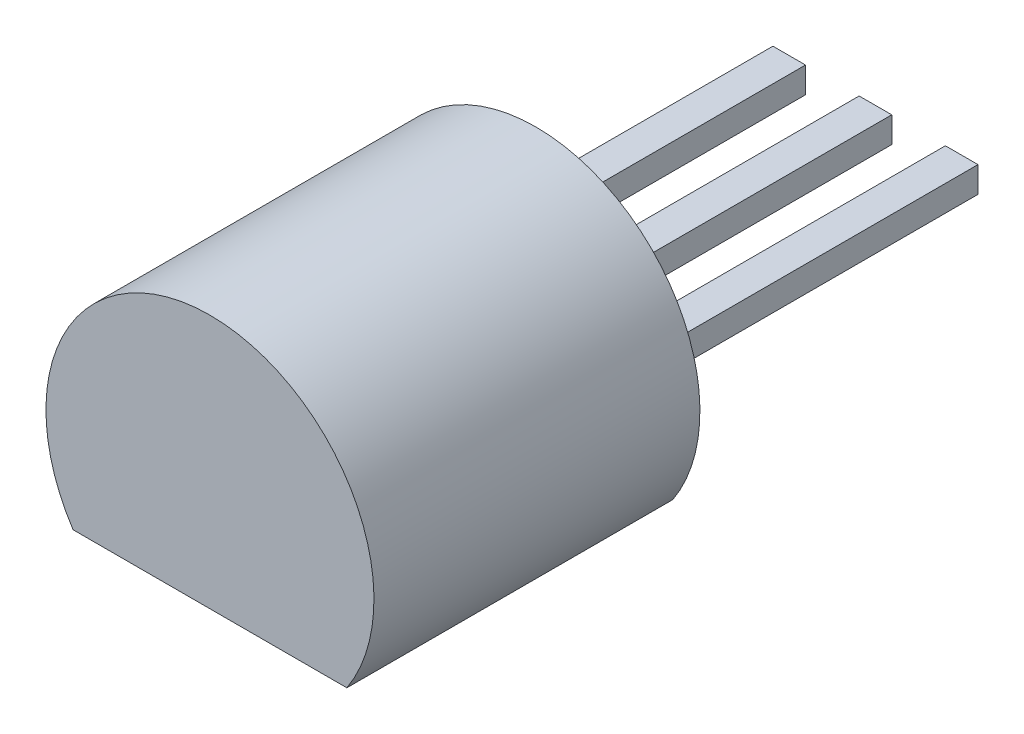
ISO-10303-21;
HEADER;
FILE_DESCRIPTION(('STEP AP214'),'2;1');
FILE_NAME('part.step','',(''),(''),'','','');
FILE_SCHEMA(('AUTOMOTIVE_DESIGN { 1 0 10303 214 1 1 1 1 }'));
ENDSEC;
DATA;
#1=APPLICATION_CONTEXT('core data for automotive mechanical design processes');
#2=APPLICATION_PROTOCOL_DEFINITION('international standard','automotive_design',2000,#1);
#3=PRODUCT_CONTEXT('',#1,'mechanical');
#4=PRODUCT('Part','Part','',(#3));
#5=PRODUCT_RELATED_PRODUCT_CATEGORY('part','',(#4));
#6=PRODUCT_DEFINITION_FORMATION('','',#4);
#7=PRODUCT_DEFINITION_CONTEXT('part definition',#1,'design');
#8=PRODUCT_DEFINITION('design','',#6,#7);
#9=PRODUCT_DEFINITION_SHAPE('','',#8);
#10=(LENGTH_UNIT() NAMED_UNIT(*) SI_UNIT(.MILLI.,.METRE.));
#11=(NAMED_UNIT(*) PLANE_ANGLE_UNIT() SI_UNIT($,.RADIAN.));
#12=(NAMED_UNIT(*) SI_UNIT($,.STERADIAN.) SOLID_ANGLE_UNIT());
#13=UNCERTAINTY_MEASURE_WITH_UNIT(LENGTH_MEASURE(1.E-05),#10,'distance_accuracy_value','');
#14=(GEOMETRIC_REPRESENTATION_CONTEXT(3) GLOBAL_UNCERTAINTY_ASSIGNED_CONTEXT((#13)) GLOBAL_UNIT_ASSIGNED_CONTEXT((#10,
#11,#12)) REPRESENTATION_CONTEXT('',''));
#15=CARTESIAN_POINT('',(0.,0.,0.));
#16=DIRECTION('',(0.,0.,1.));
#17=DIRECTION('',(1.,0.,0.));
#18=AXIS2_PLACEMENT_3D('',#15,#16,#17);
#19=CARTESIAN_POINT('',(2.3,0.19,-2.5));
#20=DIRECTION('',(0.,0.,1.));
#21=DIRECTION('',(1.,0.,0.));
#22=AXIS2_PLACEMENT_3D('',#19,#20,#21);
#23=PLANE('',#22);
#24=DIRECTION('',(1.,0.,0.));
#25=VECTOR('',#24,1.);
#26=CARTESIAN_POINT('',(2.3,0.19,-2.5));
#27=LINE('',#26,#25);
#28=CARTESIAN_POINT('',(2.3,0.19,-2.5));
#29=VERTEX_POINT('',#28);
#30=CARTESIAN_POINT('',(2.78,0.19,-2.5));
#31=VERTEX_POINT('',#30);
#32=EDGE_CURVE('E11',#29,#31,#27,.T.);
#33=ORIENTED_EDGE('',*,*,#32,.T.);
#34=DIRECTION('',(0.,-1.,0.));
#35=VECTOR('',#34,1.);
#36=CARTESIAN_POINT('',(2.78,0.19,-2.5));
#37=LINE('',#36,#35);
#38=CARTESIAN_POINT('',(2.78,-0.19,-2.5));
#39=VERTEX_POINT('',#38);
#40=EDGE_CURVE('E131',#31,#39,#37,.T.);
#41=ORIENTED_EDGE('',*,*,#40,.T.);
#42=DIRECTION('',(-1.,0.,0.));
#43=VECTOR('',#42,1.);
#44=CARTESIAN_POINT('',(2.78,-0.19,-2.5));
#45=LINE('',#44,#43);
#46=CARTESIAN_POINT('',(2.3,-0.19,-2.5));
#47=VERTEX_POINT('',#46);
#48=EDGE_CURVE('E239',#39,#47,#45,.T.);
#49=ORIENTED_EDGE('',*,*,#48,.T.);
#50=DIRECTION('',(0.,1.,0.));
#51=VECTOR('',#50,1.);
#52=CARTESIAN_POINT('',(2.3,-0.19,-2.5));
#53=LINE('',#52,#51);
#54=EDGE_CURVE('E28',#47,#29,#53,.T.);
#55=ORIENTED_EDGE('',*,*,#54,.T.);
#56=EDGE_LOOP('',(#33,#41,#49,#55));
#57=FACE_BOUND('',#56,.T.);
#58=ADVANCED_FACE('F17',(#57),#23,.F.);
#59=CARTESIAN_POINT('',(-0.24,0.19,-2.5));
#60=DIRECTION('',(0.,0.,1.));
#61=DIRECTION('',(1.,0.,0.));
#62=AXIS2_PLACEMENT_3D('',#59,#60,#61);
#63=PLANE('',#62);
#64=DIRECTION('',(1.,0.,0.));
#65=VECTOR('',#64,1.);
#66=CARTESIAN_POINT('',(-0.24,0.19,-2.5));
#67=LINE('',#66,#65);
#68=CARTESIAN_POINT('',(-0.24,0.19,-2.5));
#69=VERTEX_POINT('',#68);
#70=CARTESIAN_POINT('',(0.24,0.19,-2.5));
#71=VERTEX_POINT('',#70);
#72=EDGE_CURVE('E242',#69,#71,#67,.T.);
#73=ORIENTED_EDGE('',*,*,#72,.T.);
#74=DIRECTION('',(0.,-1.,0.));
#75=VECTOR('',#74,1.);
#76=CARTESIAN_POINT('',(0.24,0.19,-2.5));
#77=LINE('',#76,#75);
#78=CARTESIAN_POINT('',(0.24,-0.19,-2.5));
#79=VERTEX_POINT('',#78);
#80=EDGE_CURVE('E152',#71,#79,#77,.T.);
#81=ORIENTED_EDGE('',*,*,#80,.T.);
#82=DIRECTION('',(-1.,0.,0.));
#83=VECTOR('',#82,1.);
#84=CARTESIAN_POINT('',(0.24,-0.19,-2.5));
#85=LINE('',#84,#83);
#86=CARTESIAN_POINT('',(-0.24,-0.19,-2.5));
#87=VERTEX_POINT('',#86);
#88=EDGE_CURVE('E175',#79,#87,#85,.T.);
#89=ORIENTED_EDGE('',*,*,#88,.T.);
#90=DIRECTION('',(0.,1.,0.));
#91=VECTOR('',#90,1.);
#92=CARTESIAN_POINT('',(-0.24,-0.19,-2.5));
#93=LINE('',#92,#91);
#94=EDGE_CURVE('E247',#87,#69,#93,.T.);
#95=ORIENTED_EDGE('',*,*,#94,.T.);
#96=EDGE_LOOP('',(#73,#81,#89,#95));
#97=FACE_BOUND('',#96,.T.);
#98=ADVANCED_FACE('F390',(#97),#63,.F.);
#99=CARTESIAN_POINT('',(1.03,0.19,-2.5));
#100=DIRECTION('',(0.,0.,1.));
#101=DIRECTION('',(1.,0.,0.));
#102=AXIS2_PLACEMENT_3D('',#99,#100,#101);
#103=PLANE('',#102);
#104=DIRECTION('',(1.,0.,0.));
#105=VECTOR('',#104,1.);
#106=CARTESIAN_POINT('',(1.03,0.19,-2.5));
#107=LINE('',#106,#105);
#108=CARTESIAN_POINT('',(1.03,0.19,-2.5));
#109=VERTEX_POINT('',#108);
#110=CARTESIAN_POINT('',(1.51,0.19,-2.5));
#111=VERTEX_POINT('',#110);
#112=EDGE_CURVE('E205',#109,#111,#107,.T.);
#113=ORIENTED_EDGE('',*,*,#112,.T.);
#114=DIRECTION('',(0.,-1.,0.));
#115=VECTOR('',#114,1.);
#116=CARTESIAN_POINT('',(1.51,0.19,-2.5));
#117=LINE('',#116,#115);
#118=CARTESIAN_POINT('',(1.51,-0.19,-2.5));
#119=VERTEX_POINT('',#118);
#120=EDGE_CURVE('E209',#111,#119,#117,.T.);
#121=ORIENTED_EDGE('',*,*,#120,.T.);
#122=DIRECTION('',(-1.,0.,0.));
#123=VECTOR('',#122,1.);
#124=CARTESIAN_POINT('',(1.51,-0.19,-2.5));
#125=LINE('',#124,#123);
#126=CARTESIAN_POINT('',(1.03,-0.19,-2.5));
#127=VERTEX_POINT('',#126);
#128=EDGE_CURVE('E167',#119,#127,#125,.T.);
#129=ORIENTED_EDGE('',*,*,#128,.T.);
#130=DIRECTION('',(0.,1.,0.));
#131=VECTOR('',#130,1.);
#132=CARTESIAN_POINT('',(1.03,-0.19,-2.5));
#133=LINE('',#132,#131);
#134=EDGE_CURVE('E219',#127,#109,#133,.T.);
#135=ORIENTED_EDGE('',*,*,#134,.T.);
#136=EDGE_LOOP('',(#113,#121,#129,#135));
#137=FACE_BOUND('',#136,.T.);
#138=ADVANCED_FACE('F294',(#137),#103,.F.);
#139=CARTESIAN_POINT('',(2.3,0.19,2.5));
#140=DIRECTION('',(0.,-1.,0.));
#141=DIRECTION('',(0.,0.,-1.));
#142=AXIS2_PLACEMENT_3D('',#139,#140,#141);
#143=PLANE('',#142);
#144=DIRECTION('',(1.,0.,0.));
#145=VECTOR('',#144,1.);
#146=CARTESIAN_POINT('',(2.3,0.19,2.5));
#147=LINE('',#146,#145);
#148=CARTESIAN_POINT('',(2.3,0.19,2.5));
#149=VERTEX_POINT('',#148);
#150=CARTESIAN_POINT('',(2.78,0.19,2.5));
#151=VERTEX_POINT('',#150);
#152=EDGE_CURVE('E138',#149,#151,#147,.T.);
#153=ORIENTED_EDGE('',*,*,#152,.T.);
#154=DIRECTION('',(0.,0.,-1.));
#155=VECTOR('',#154,1.);
#156=CARTESIAN_POINT('',(2.78,0.19,2.5));
#157=LINE('',#156,#155);
#158=EDGE_CURVE('E135',#151,#31,#157,.T.);
#159=ORIENTED_EDGE('',*,*,#158,.T.);
#160=ORIENTED_EDGE('',*,*,#32,.F.);
#161=DIRECTION('',(0.,0.,-1.));
#162=VECTOR('',#161,1.);
#163=CARTESIAN_POINT('',(2.3,0.19,2.5));
#164=LINE('',#163,#162);
#165=EDGE_CURVE('E189',#149,#29,#164,.T.);
#166=ORIENTED_EDGE('',*,*,#165,.F.);
#167=EDGE_LOOP('',(#153,#159,#160,#166));
#168=FACE_BOUND('',#167,.T.);
#169=ADVANCED_FACE('F136',(#168),#143,.F.);
#170=CARTESIAN_POINT('',(2.3,-0.19,2.5));
#171=DIRECTION('',(1.,0.,0.));
#172=DIRECTION('',(0.,1.,0.));
#173=AXIS2_PLACEMENT_3D('',#170,#171,#172);
#174=PLANE('',#173);
#175=DIRECTION('',(0.,1.,0.));
#176=VECTOR('',#175,1.);
#177=CARTESIAN_POINT('',(2.3,-0.19,2.5));
#178=LINE('',#177,#176);
#179=CARTESIAN_POINT('',(2.3,-0.19,2.5));
#180=VERTEX_POINT('',#179);
#181=EDGE_CURVE('E196',#180,#149,#178,.T.);
#182=ORIENTED_EDGE('',*,*,#181,.T.);
#183=ORIENTED_EDGE('',*,*,#165,.T.);
#184=ORIENTED_EDGE('',*,*,#54,.F.);
#185=DIRECTION('',(0.,0.,-1.));
#186=VECTOR('',#185,1.);
#187=CARTESIAN_POINT('',(2.3,-0.19,2.5));
#188=LINE('',#187,#186);
#189=EDGE_CURVE('E143',#180,#47,#188,.T.);
#190=ORIENTED_EDGE('',*,*,#189,.F.);
#191=EDGE_LOOP('',(#182,#183,#184,#190));
#192=FACE_BOUND('',#191,.T.);
#193=ADVANCED_FACE('F369',(#192),#174,.F.);
#194=CARTESIAN_POINT('',(2.78,-0.19,2.5));
#195=DIRECTION('',(0.,1.,0.));
#196=DIRECTION('',(1.,0.,0.));
#197=AXIS2_PLACEMENT_3D('',#194,#195,#196);
#198=PLANE('',#197);
#199=DIRECTION('',(-1.,0.,0.));
#200=VECTOR('',#199,1.);
#201=CARTESIAN_POINT('',(2.78,-0.19,2.5));
#202=LINE('',#201,#200);
#203=CARTESIAN_POINT('',(2.78,-0.19,2.5));
#204=VERTEX_POINT('',#203);
#205=EDGE_CURVE('E214',#204,#180,#202,.T.);
#206=ORIENTED_EDGE('',*,*,#205,.T.);
#207=ORIENTED_EDGE('',*,*,#189,.T.);
#208=ORIENTED_EDGE('',*,*,#48,.F.);
#209=DIRECTION('',(0.,0.,-1.));
#210=VECTOR('',#209,1.);
#211=CARTESIAN_POINT('',(2.78,-0.19,2.5));
#212=LINE('',#211,#210);
#213=EDGE_CURVE('E146',#204,#39,#212,.T.);
#214=ORIENTED_EDGE('',*,*,#213,.F.);
#215=EDGE_LOOP('',(#206,#207,#208,#214));
#216=FACE_BOUND('',#215,.T.);
#217=ADVANCED_FACE('F437',(#216),#198,.F.);
#218=CARTESIAN_POINT('',(2.78,0.19,2.5));
#219=DIRECTION('',(-1.,0.,0.));
#220=DIRECTION('',(0.,0.,1.));
#221=AXIS2_PLACEMENT_3D('',#218,#219,#220);
#222=PLANE('',#221);
#223=DIRECTION('',(0.,-1.,0.));
#224=VECTOR('',#223,1.);
#225=CARTESIAN_POINT('',(2.78,0.19,2.5));
#226=LINE('',#225,#224);
#227=EDGE_CURVE('E159',#151,#204,#226,.T.);
#228=ORIENTED_EDGE('',*,*,#227,.T.);
#229=ORIENTED_EDGE('',*,*,#213,.T.);
#230=ORIENTED_EDGE('',*,*,#40,.F.);
#231=ORIENTED_EDGE('',*,*,#158,.F.);
#232=EDGE_LOOP('',(#228,#229,#230,#231));
#233=FACE_BOUND('',#232,.T.);
#234=ADVANCED_FACE('F145',(#233),#222,.F.);
#235=CARTESIAN_POINT('',(0.24,0.19,2.5));
#236=DIRECTION('',(-1.,0.,0.));
#237=DIRECTION('',(0.,0.,1.));
#238=AXIS2_PLACEMENT_3D('',#235,#236,#237);
#239=PLANE('',#238);
#240=DIRECTION('',(0.,-1.,0.));
#241=VECTOR('',#240,1.);
#242=CARTESIAN_POINT('',(0.24,0.19,2.5));
#243=LINE('',#242,#241);
#244=CARTESIAN_POINT('',(0.24,0.19,2.5));
#245=VERTEX_POINT('',#244);
#246=CARTESIAN_POINT('',(0.24,-0.19,2.5));
#247=VERTEX_POINT('',#246);
#248=EDGE_CURVE('E185',#245,#247,#243,.T.);
#249=ORIENTED_EDGE('',*,*,#248,.T.);
#250=DIRECTION('',(0.,0.,-1.));
#251=VECTOR('',#250,1.);
#252=CARTESIAN_POINT('',(0.24,-0.19,2.5));
#253=LINE('',#252,#251);
#254=EDGE_CURVE('E179',#247,#79,#253,.T.);
#255=ORIENTED_EDGE('',*,*,#254,.T.);
#256=ORIENTED_EDGE('',*,*,#80,.F.);
#257=DIRECTION('',(0.,0.,-1.));
#258=VECTOR('',#257,1.);
#259=CARTESIAN_POINT('',(0.24,0.19,2.5));
#260=LINE('',#259,#258);
#261=EDGE_CURVE('E243',#245,#71,#260,.T.);
#262=ORIENTED_EDGE('',*,*,#261,.F.);
#263=EDGE_LOOP('',(#249,#255,#256,#262));
#264=FACE_BOUND('',#263,.T.);
#265=ADVANCED_FACE('F345',(#264),#239,.F.);
#266=CARTESIAN_POINT('',(-0.24,0.19,2.5));
#267=DIRECTION('',(0.,-1.,0.));
#268=DIRECTION('',(0.,0.,-1.));
#269=AXIS2_PLACEMENT_3D('',#266,#267,#268);
#270=PLANE('',#269);
#271=DIRECTION('',(1.,0.,0.));
#272=VECTOR('',#271,1.);
#273=CARTESIAN_POINT('',(-0.24,0.19,2.5));
#274=LINE('',#273,#272);
#275=CARTESIAN_POINT('',(-0.24,0.19,2.5));
#276=VERTEX_POINT('',#275);
#277=EDGE_CURVE('E160',#276,#245,#274,.T.);
#278=ORIENTED_EDGE('',*,*,#277,.T.);
#279=ORIENTED_EDGE('',*,*,#261,.T.);
#280=ORIENTED_EDGE('',*,*,#72,.F.);
#281=DIRECTION('',(0.,0.,-1.));
#282=VECTOR('',#281,1.);
#283=CARTESIAN_POINT('',(-0.24,0.19,2.5));
#284=LINE('',#283,#282);
#285=EDGE_CURVE('E232',#276,#69,#284,.T.);
#286=ORIENTED_EDGE('',*,*,#285,.F.);
#287=EDGE_LOOP('',(#278,#279,#280,#286));
#288=FACE_BOUND('',#287,.T.);
#289=ADVANCED_FACE('F349',(#288),#270,.F.);
#290=CARTESIAN_POINT('',(-0.24,-0.19,2.5));
#291=DIRECTION('',(1.,0.,0.));
#292=DIRECTION('',(0.,1.,0.));
#293=AXIS2_PLACEMENT_3D('',#290,#291,#292);
#294=PLANE('',#293);
#295=DIRECTION('',(0.,1.,0.));
#296=VECTOR('',#295,1.);
#297=CARTESIAN_POINT('',(-0.24,-0.19,2.5));
#298=LINE('',#297,#296);
#299=CARTESIAN_POINT('',(-0.24,-0.19,2.5));
#300=VERTEX_POINT('',#299);
#301=EDGE_CURVE('E156',#300,#276,#298,.T.);
#302=ORIENTED_EDGE('',*,*,#301,.T.);
#303=ORIENTED_EDGE('',*,*,#285,.T.);
#304=ORIENTED_EDGE('',*,*,#94,.F.);
#305=DIRECTION('',(0.,0.,-1.));
#306=VECTOR('',#305,1.);
#307=CARTESIAN_POINT('',(-0.24,-0.19,2.5));
#308=LINE('',#307,#306);
#309=EDGE_CURVE('E180',#300,#87,#308,.T.);
#310=ORIENTED_EDGE('',*,*,#309,.F.);
#311=EDGE_LOOP('',(#302,#303,#304,#310));
#312=FACE_BOUND('',#311,.T.);
#313=ADVANCED_FACE('F359',(#312),#294,.F.);
#314=CARTESIAN_POINT('',(0.24,-0.19,2.5));
#315=DIRECTION('',(0.,1.,0.));
#316=DIRECTION('',(1.,0.,0.));
#317=AXIS2_PLACEMENT_3D('',#314,#315,#316);
#318=PLANE('',#317);
#319=DIRECTION('',(-1.,0.,0.));
#320=VECTOR('',#319,1.);
#321=CARTESIAN_POINT('',(0.24,-0.19,2.5));
#322=LINE('',#321,#320);
#323=EDGE_CURVE('E181',#247,#300,#322,.T.);
#324=ORIENTED_EDGE('',*,*,#323,.T.);
#325=ORIENTED_EDGE('',*,*,#309,.T.);
#326=ORIENTED_EDGE('',*,*,#88,.F.);
#327=ORIENTED_EDGE('',*,*,#254,.F.);
#328=EDGE_LOOP('',(#324,#325,#326,#327));
#329=FACE_BOUND('',#328,.T.);
#330=ADVANCED_FACE('F355',(#329),#318,.F.);
#331=CARTESIAN_POINT('',(1.51,0.19,2.5));
#332=DIRECTION('',(-1.,0.,0.));
#333=DIRECTION('',(0.,0.,1.));
#334=AXIS2_PLACEMENT_3D('',#331,#332,#333);
#335=PLANE('',#334);
#336=DIRECTION('',(0.,-1.,0.));
#337=VECTOR('',#336,1.);
#338=CARTESIAN_POINT('',(1.51,0.19,2.5));
#339=LINE('',#338,#337);
#340=CARTESIAN_POINT('',(1.51,0.19,2.5));
#341=VERTEX_POINT('',#340);
#342=CARTESIAN_POINT('',(1.51,-0.19,2.5));
#343=VERTEX_POINT('',#342);
#344=EDGE_CURVE('E21',#341,#343,#339,.T.);
#345=ORIENTED_EDGE('',*,*,#344,.T.);
#346=DIRECTION('',(0.,0.,-1.));
#347=VECTOR('',#346,1.);
#348=CARTESIAN_POINT('',(1.51,-0.19,2.5));
#349=LINE('',#348,#347);
#350=EDGE_CURVE('E171',#343,#119,#349,.T.);
#351=ORIENTED_EDGE('',*,*,#350,.T.);
#352=ORIENTED_EDGE('',*,*,#120,.F.);
#353=DIRECTION('',(0.,0.,-1.));
#354=VECTOR('',#353,1.);
#355=CARTESIAN_POINT('',(1.51,0.19,2.5));
#356=LINE('',#355,#354);
#357=EDGE_CURVE('E210',#341,#111,#356,.T.);
#358=ORIENTED_EDGE('',*,*,#357,.F.);
#359=EDGE_LOOP('',(#345,#351,#352,#358));
#360=FACE_BOUND('',#359,.T.);
#361=ADVANCED_FACE('F299',(#360),#335,.F.);
#362=CARTESIAN_POINT('',(1.03,0.19,2.5));
#363=DIRECTION('',(0.,-1.,0.));
#364=DIRECTION('',(0.,0.,-1.));
#365=AXIS2_PLACEMENT_3D('',#362,#363,#364);
#366=PLANE('',#365);
#367=DIRECTION('',(1.,0.,0.));
#368=VECTOR('',#367,1.);
#369=CARTESIAN_POINT('',(1.03,0.19,2.5));
#370=LINE('',#369,#368);
#371=CARTESIAN_POINT('',(1.03,0.19,2.5));
#372=VERTEX_POINT('',#371);
#373=EDGE_CURVE('E190',#372,#341,#370,.T.);
#374=ORIENTED_EDGE('',*,*,#373,.T.);
#375=ORIENTED_EDGE('',*,*,#357,.T.);
#376=ORIENTED_EDGE('',*,*,#112,.F.);
#377=DIRECTION('',(0.,0.,-1.));
#378=VECTOR('',#377,1.);
#379=CARTESIAN_POINT('',(1.03,0.19,2.5));
#380=LINE('',#379,#378);
#381=EDGE_CURVE('E215',#372,#109,#380,.T.);
#382=ORIENTED_EDGE('',*,*,#381,.F.);
#383=EDGE_LOOP('',(#374,#375,#376,#382));
#384=FACE_BOUND('',#383,.T.);
#385=ADVANCED_FACE('F311',(#384),#366,.F.);
#386=CARTESIAN_POINT('',(1.03,-0.19,2.5));
#387=DIRECTION('',(1.,0.,0.));
#388=DIRECTION('',(0.,1.,0.));
#389=AXIS2_PLACEMENT_3D('',#386,#387,#388);
#390=PLANE('',#389);
#391=DIRECTION('',(0.,1.,0.));
#392=VECTOR('',#391,1.);
#393=CARTESIAN_POINT('',(1.03,-0.19,2.5));
#394=LINE('',#393,#392);
#395=CARTESIAN_POINT('',(1.03,-0.19,2.5));
#396=VERTEX_POINT('',#395);
#397=EDGE_CURVE('E186',#396,#372,#394,.T.);
#398=ORIENTED_EDGE('',*,*,#397,.T.);
#399=ORIENTED_EDGE('',*,*,#381,.T.);
#400=ORIENTED_EDGE('',*,*,#134,.F.);
#401=DIRECTION('',(0.,0.,-1.));
#402=VECTOR('',#401,1.);
#403=CARTESIAN_POINT('',(1.03,-0.19,2.5));
#404=LINE('',#403,#402);
#405=EDGE_CURVE('E172',#396,#127,#404,.T.);
#406=ORIENTED_EDGE('',*,*,#405,.F.);
#407=EDGE_LOOP('',(#398,#399,#400,#406));
#408=FACE_BOUND('',#407,.T.);
#409=ADVANCED_FACE('F305',(#408),#390,.F.);
#410=CARTESIAN_POINT('',(1.51,-0.19,2.5));
#411=DIRECTION('',(0.,1.,0.));
#412=DIRECTION('',(1.,0.,0.));
#413=AXIS2_PLACEMENT_3D('',#410,#411,#412);
#414=PLANE('',#413);
#415=DIRECTION('',(-1.,0.,0.));
#416=VECTOR('',#415,1.);
#417=CARTESIAN_POINT('',(1.51,-0.19,2.5));
#418=LINE('',#417,#416);
#419=EDGE_CURVE('E165',#343,#396,#418,.T.);
#420=ORIENTED_EDGE('',*,*,#419,.T.);
#421=ORIENTED_EDGE('',*,*,#405,.T.);
#422=ORIENTED_EDGE('',*,*,#128,.F.);
#423=ORIENTED_EDGE('',*,*,#350,.F.);
#424=EDGE_LOOP('',(#420,#421,#422,#423));
#425=FACE_BOUND('',#424,.T.);
#426=ADVANCED_FACE('F19',(#425),#414,.F.);
#427=CARTESIAN_POINT('',(-0.745769083998,-1.33,7.3));
#428=DIRECTION('',(0.,0.,-1.));
#429=DIRECTION('',(0.,-1.,0.));
#430=AXIS2_PLACEMENT_3D('',#427,#428,#429);
#431=PLANE('',#430);
#432=DIRECTION('',(1.,0.,0.));
#433=VECTOR('',#432,1.);
#434=CARTESIAN_POINT('',(-0.745769083998,-1.33,7.3));
#435=LINE('',#434,#433);
#436=CARTESIAN_POINT('',(-0.745769083998,-1.33,7.3));
#437=VERTEX_POINT('',#436);
#438=CARTESIAN_POINT('',(3.285769083998,-1.33,7.3));
#439=VERTEX_POINT('',#438);
#440=EDGE_CURVE('E197',#437,#439,#435,.T.);
#441=ORIENTED_EDGE('',*,*,#440,.T.);
#442=CARTESIAN_POINT('',(1.27,0.,7.3));
#443=DIRECTION('',(0.,0.,1.));
#444=DIRECTION('',(1.,0.,0.));
#445=AXIS2_PLACEMENT_3D('',#442,#443,#444);
#446=CIRCLE('',#445,2.415);
#447=EDGE_CURVE('E161',#439,#437,#446,.T.);
#448=ORIENTED_EDGE('',*,*,#447,.T.);
#449=EDGE_LOOP('',(#441,#448));
#450=FACE_BOUND('',#449,.T.);
#451=ADVANCED_FACE('F338',(#450),#431,.F.);
#452=CARTESIAN_POINT('',(-0.745769083998,-1.33,2.5));
#453=DIRECTION('',(0.,0.,-1.));
#454=DIRECTION('',(0.,-1.,0.));
#455=AXIS2_PLACEMENT_3D('',#452,#453,#454);
#456=PLANE('',#455);
#457=ORIENTED_EDGE('',*,*,#227,.F.);
#458=ORIENTED_EDGE('',*,*,#152,.F.);
#459=ORIENTED_EDGE('',*,*,#181,.F.);
#460=ORIENTED_EDGE('',*,*,#205,.F.);
#461=EDGE_LOOP('',(#457,#458,#459,#460));
#462=FACE_BOUND('',#461,.T.);
#463=ORIENTED_EDGE('',*,*,#323,.F.);
#464=ORIENTED_EDGE('',*,*,#248,.F.);
#465=ORIENTED_EDGE('',*,*,#277,.F.);
#466=ORIENTED_EDGE('',*,*,#301,.F.);
#467=EDGE_LOOP('',(#463,#464,#465,#466));
#468=FACE_BOUND('',#467,.T.);
#469=ORIENTED_EDGE('',*,*,#419,.F.);
#470=ORIENTED_EDGE('',*,*,#344,.F.);
#471=ORIENTED_EDGE('',*,*,#373,.F.);
#472=ORIENTED_EDGE('',*,*,#397,.F.);
#473=EDGE_LOOP('',(#469,#470,#471,#472));
#474=FACE_BOUND('',#473,.T.);
#475=DIRECTION('',(1.,0.,0.));
#476=VECTOR('',#475,1.);
#477=CARTESIAN_POINT('',(-0.745769083998,-1.33,2.5));
#478=LINE('',#477,#476);
#479=CARTESIAN_POINT('',(-0.745769083998,-1.33,2.5));
#480=VERTEX_POINT('',#479);
#481=CARTESIAN_POINT('',(3.285769083998,-1.33,2.5));
#482=VERTEX_POINT('',#481);
#483=EDGE_CURVE('E226',#480,#482,#478,.T.);
#484=ORIENTED_EDGE('',*,*,#483,.F.);
#485=CARTESIAN_POINT('',(1.27,0.,2.5));
#486=DIRECTION('',(0.,0.,1.));
#487=DIRECTION('',(1.,0.,0.));
#488=AXIS2_PLACEMENT_3D('',#485,#486,#487);
#489=CIRCLE('',#488,2.415);
#490=EDGE_CURVE('E166',#482,#480,#489,.T.);
#491=ORIENTED_EDGE('',*,*,#490,.F.);
#492=EDGE_LOOP('',(#484,#491));
#493=FACE_BOUND('',#492,.T.);
#494=ADVANCED_FACE('F308',(#462,#468,#474,#493),#456,.T.);
#495=CARTESIAN_POINT('',(1.27,0.,2.5));
#496=DIRECTION('',(0.,0.,-1.));
#497=DIRECTION('',(1.,0.,0.));
#498=AXIS2_PLACEMENT_3D('',#495,#496,#497);
#499=CYLINDRICAL_SURFACE('',#498,2.415);
#500=ORIENTED_EDGE('',*,*,#490,.T.);
#501=DIRECTION('',(0.,0.,1.));
#502=VECTOR('',#501,1.);
#503=CARTESIAN_POINT('',(-0.745769083998,-1.33,2.5));
#504=LINE('',#503,#502);
#505=EDGE_CURVE('E201',#480,#437,#504,.T.);
#506=ORIENTED_EDGE('',*,*,#505,.T.);
#507=ORIENTED_EDGE('',*,*,#447,.F.);
#508=DIRECTION('',(0.,0.,1.));
#509=VECTOR('',#508,1.);
#510=CARTESIAN_POINT('',(3.285769083998,-1.33,2.5));
#511=LINE('',#510,#509);
#512=EDGE_CURVE('E202',#482,#439,#511,.T.);
#513=ORIENTED_EDGE('',*,*,#512,.F.);
#514=EDGE_LOOP('',(#500,#506,#507,#513));
#515=FACE_BOUND('',#514,.T.);
#516=ADVANCED_FACE('F375',(#515),#499,.T.);
#517=CARTESIAN_POINT('',(-0.745769083998,-1.33,2.5));
#518=DIRECTION('',(0.,1.,0.));
#519=DIRECTION('',(1.,0.,0.));
#520=AXIS2_PLACEMENT_3D('',#517,#518,#519);
#521=PLANE('',#520);
#522=ORIENTED_EDGE('',*,*,#483,.T.);
#523=ORIENTED_EDGE('',*,*,#512,.T.);
#524=ORIENTED_EDGE('',*,*,#440,.F.);
#525=ORIENTED_EDGE('',*,*,#505,.F.);
#526=EDGE_LOOP('',(#522,#523,#524,#525));
#527=FACE_BOUND('',#526,.T.);
#528=ADVANCED_FACE('F379',(#527),#521,.F.);
#529=CLOSED_SHELL('',(#58,#98,#138,#169,#193,#217,#234,#265,#289,#313,#330,#361,#385,#409,#426,
#451,#494,#516,#528));
#530=MANIFOLD_SOLID_BREP('B1',#529);
#531=ADVANCED_BREP_SHAPE_REPRESENTATION('',(#18,#530),#14);
#532=SHAPE_DEFINITION_REPRESENTATION(#9,#531);
ENDSEC;
END-ISO-10303-21;
